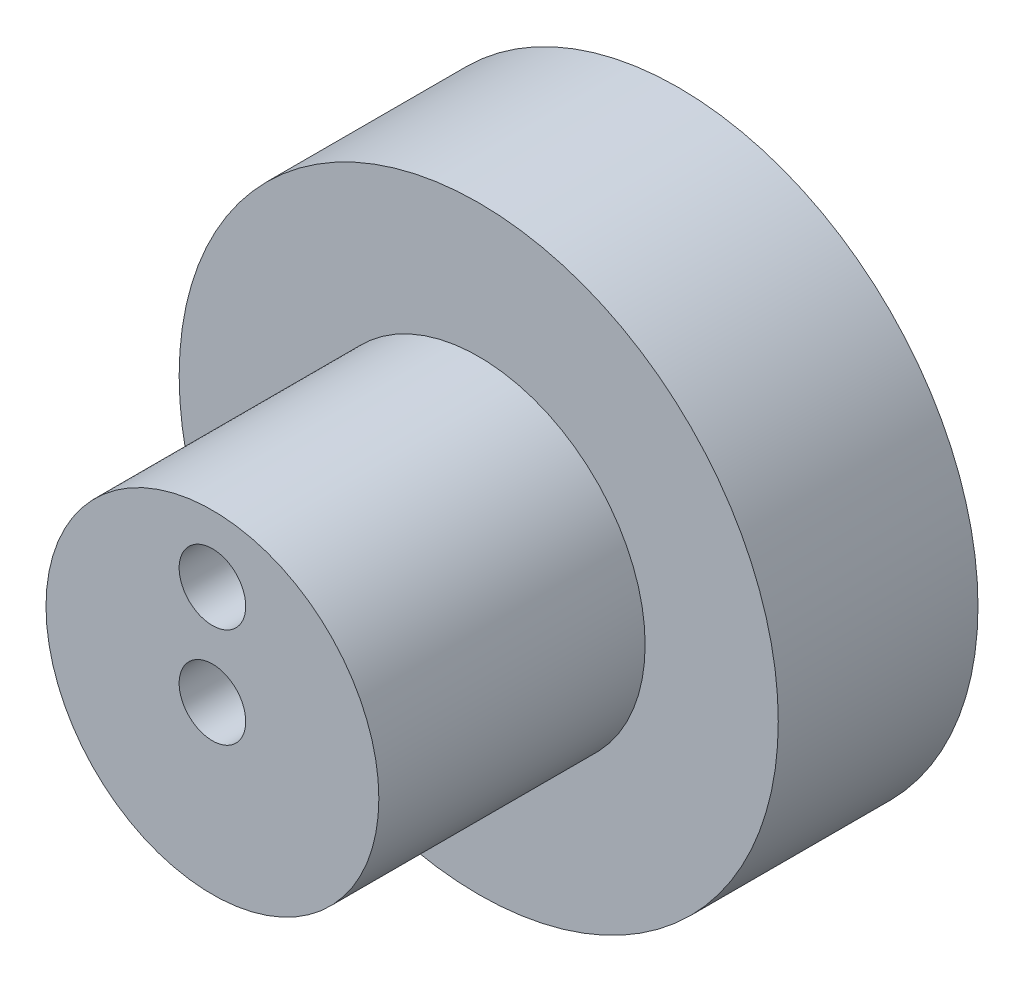
ISO-10303-21;
HEADER;
FILE_DESCRIPTION(('STEP AP214'),'2;1');
FILE_NAME('part.step','',(''),(''),'','','');
FILE_SCHEMA(('AUTOMOTIVE_DESIGN { 1 0 10303 214 1 1 1 1 }'));
ENDSEC;
DATA;
#1=APPLICATION_CONTEXT('core data for automotive mechanical design processes');
#2=APPLICATION_PROTOCOL_DEFINITION('international standard','automotive_design',2000,#1);
#3=PRODUCT_CONTEXT('',#1,'mechanical');
#4=PRODUCT('Part','Part','',(#3));
#5=PRODUCT_RELATED_PRODUCT_CATEGORY('part','',(#4));
#6=PRODUCT_DEFINITION_FORMATION('','',#4);
#7=PRODUCT_DEFINITION_CONTEXT('part definition',#1,'design');
#8=PRODUCT_DEFINITION('design','',#6,#7);
#9=PRODUCT_DEFINITION_SHAPE('','',#8);
#10=(LENGTH_UNIT() NAMED_UNIT(*) SI_UNIT(.MILLI.,.METRE.));
#11=(NAMED_UNIT(*) PLANE_ANGLE_UNIT() SI_UNIT($,.RADIAN.));
#12=(NAMED_UNIT(*) SI_UNIT($,.STERADIAN.) SOLID_ANGLE_UNIT());
#13=UNCERTAINTY_MEASURE_WITH_UNIT(LENGTH_MEASURE(1.E-05),#10,'distance_accuracy_value','');
#14=(GEOMETRIC_REPRESENTATION_CONTEXT(3) GLOBAL_UNCERTAINTY_ASSIGNED_CONTEXT((#13)) GLOBAL_UNIT_ASSIGNED_CONTEXT((#10,
#11,#12)) REPRESENTATION_CONTEXT('',''));
#15=CARTESIAN_POINT('',(0.,0.,0.));
#16=DIRECTION('',(0.,0.,1.));
#17=DIRECTION('',(1.,0.,0.));
#18=AXIS2_PLACEMENT_3D('',#15,#16,#17);
#19=CARTESIAN_POINT('',(0.,0.,30.));
#20=DIRECTION('',(0.,0.,0.999999999999994));
#21=DIRECTION('',(1.00000000000002,0.,0.));
#22=AXIS2_PLACEMENT_3D('',#19,#20,#21);
#23=PLANE('',#22);
#24=CARTESIAN_POINT('',(0.,0.,30.));
#25=DIRECTION('',(0.,0.,0.999999999999994));
#26=DIRECTION('',(1.00000000000002,0.,0.));
#27=AXIS2_PLACEMENT_3D('',#24,#25,#26);
#28=CIRCLE('',#27,45.);
#29=CARTESIAN_POINT('',(45.0000000000007,0.,30.));
#30=VERTEX_POINT('',#29);
#31=EDGE_CURVE('E10',#30,#30,#28,.T.);
#32=ORIENTED_EDGE('',*,*,#31,.T.);
#33=EDGE_LOOP('',(#32));
#34=FACE_BOUND('',#33,.T.);
#35=CARTESIAN_POINT('',(0.,0.,30.));
#36=DIRECTION('',(0.,0.,0.999999999999994));
#37=DIRECTION('',(1.00000000000002,0.,0.));
#38=AXIS2_PLACEMENT_3D('',#35,#36,#37);
#39=CIRCLE('',#38,25.);
#40=CARTESIAN_POINT('',(25.0000000000004,0.,30.));
#41=VERTEX_POINT('',#40);
#42=EDGE_CURVE('E43',#41,#41,#39,.T.);
#43=ORIENTED_EDGE('',*,*,#42,.F.);
#44=EDGE_LOOP('',(#43));
#45=FACE_BOUND('',#44,.T.);
#46=ADVANCED_FACE('F30',(#34,#45),#23,.T.);
#47=CARTESIAN_POINT('',(0.,0.,30.));
#48=DIRECTION('',(0.,0.,-0.999999999999994));
#49=DIRECTION('',(-1.00000000000002,0.,0.));
#50=AXIS2_PLACEMENT_3D('',#47,#48,#49);
#51=CYLINDRICAL_SURFACE('',#50,45.);
#52=ORIENTED_EDGE('',*,*,#31,.F.);
#53=EDGE_LOOP('',(#52));
#54=FACE_BOUND('',#53,.T.);
#55=CARTESIAN_POINT('',(0.,0.,0.));
#56=DIRECTION('',(0.,0.,0.999999999999994));
#57=DIRECTION('',(1.00000000000002,0.,0.));
#58=AXIS2_PLACEMENT_3D('',#55,#56,#57);
#59=CIRCLE('',#58,45.);
#60=CARTESIAN_POINT('',(45.0000000000007,0.,0.));
#61=VERTEX_POINT('',#60);
#62=EDGE_CURVE('E34',#61,#61,#59,.T.);
#63=ORIENTED_EDGE('',*,*,#62,.T.);
#64=EDGE_LOOP('',(#63));
#65=FACE_BOUND('',#64,.T.);
#66=ADVANCED_FACE('F32',(#54,#65),#51,.T.);
#67=CARTESIAN_POINT('',(0.,0.,0.));
#68=DIRECTION('',(0.,0.,0.999999999999994));
#69=DIRECTION('',(1.00000000000002,0.,0.));
#70=AXIS2_PLACEMENT_3D('',#67,#68,#69);
#71=PLANE('',#70);
#72=CARTESIAN_POINT('',(0.,15.0000000000001,0.));
#73=DIRECTION('',(0.,0.,-0.999999999999994));
#74=DIRECTION('',(-1.00000000000002,0.,0.));
#75=AXIS2_PLACEMENT_3D('',#72,#73,#74);
#76=CIRCLE('',#75,5.);
#77=CARTESIAN_POINT('',(-5.00000000000008,15.0000000000001,0.));
#78=VERTEX_POINT('',#77);
#79=EDGE_CURVE('E61',#78,#78,#76,.T.);
#80=ORIENTED_EDGE('',*,*,#79,.F.);
#81=EDGE_LOOP('',(#80));
#82=FACE_BOUND('',#81,.T.);
#83=CARTESIAN_POINT('',(0.,0.,0.));
#84=DIRECTION('',(0.,0.,0.999999999999994));
#85=DIRECTION('',(1.00000000000002,0.,0.));
#86=AXIS2_PLACEMENT_3D('',#83,#84,#85);
#87=CIRCLE('',#86,5.);
#88=CARTESIAN_POINT('',(5.00000000000008,0.,0.));
#89=VERTEX_POINT('',#88);
#90=EDGE_CURVE('E46',#89,#89,#87,.T.);
#91=ORIENTED_EDGE('',*,*,#90,.T.);
#92=EDGE_LOOP('',(#91));
#93=FACE_BOUND('',#92,.T.);
#94=ORIENTED_EDGE('',*,*,#62,.F.);
#95=EDGE_LOOP('',(#94));
#96=FACE_BOUND('',#95,.T.);
#97=ADVANCED_FACE('F76',(#82,#93,#96),#71,.F.);
#98=CARTESIAN_POINT('',(0.,0.,69.9999999999995));
#99=DIRECTION('',(0.,0.,-0.999999999999994));
#100=DIRECTION('',(-1.00000000000002,0.,0.));
#101=AXIS2_PLACEMENT_3D('',#98,#99,#100);
#102=CYLINDRICAL_SURFACE('',#101,25.);
#103=CARTESIAN_POINT('',(0.,0.,69.9999999999995));
#104=DIRECTION('',(0.,0.,0.999999999999994));
#105=DIRECTION('',(1.00000000000002,0.,0.));
#106=AXIS2_PLACEMENT_3D('',#103,#104,#105);
#107=CIRCLE('',#106,25.);
#108=CARTESIAN_POINT('',(25.0000000000004,0.,69.9999999999995));
#109=VERTEX_POINT('',#108);
#110=EDGE_CURVE('E41',#109,#109,#107,.T.);
#111=ORIENTED_EDGE('',*,*,#110,.F.);
#112=EDGE_LOOP('',(#111));
#113=FACE_BOUND('',#112,.T.);
#114=ORIENTED_EDGE('',*,*,#42,.T.);
#115=EDGE_LOOP('',(#114));
#116=FACE_BOUND('',#115,.T.);
#117=ADVANCED_FACE('F79',(#113,#116),#102,.T.);
#118=CARTESIAN_POINT('',(0.,0.,69.9999999999995));
#119=DIRECTION('',(0.,0.,0.999999999999994));
#120=DIRECTION('',(1.00000000000002,0.,0.));
#121=AXIS2_PLACEMENT_3D('',#118,#119,#120);
#122=PLANE('',#121);
#123=CARTESIAN_POINT('',(0.,15.0000000000001,69.9999999999995));
#124=DIRECTION('',(0.,0.,0.999999999999994));
#125=DIRECTION('',(1.00000000000002,0.,0.));
#126=AXIS2_PLACEMENT_3D('',#123,#124,#125);
#127=CIRCLE('',#126,5.);
#128=CARTESIAN_POINT('',(5.00000000000013,15.0000000000001,69.9999999999995));
#129=VERTEX_POINT('',#128);
#130=EDGE_CURVE('E55',#129,#129,#127,.T.);
#131=ORIENTED_EDGE('',*,*,#130,.F.);
#132=EDGE_LOOP('',(#131));
#133=FACE_BOUND('',#132,.T.);
#134=CARTESIAN_POINT('',(0.,0.,69.9999999999995));
#135=DIRECTION('',(0.,0.,0.999999999999994));
#136=DIRECTION('',(1.00000000000002,0.,0.));
#137=AXIS2_PLACEMENT_3D('',#134,#135,#136);
#138=CIRCLE('',#137,5.);
#139=CARTESIAN_POINT('',(5.00000000000008,0.,69.9999999999995));
#140=VERTEX_POINT('',#139);
#141=EDGE_CURVE('E49',#140,#140,#138,.T.);
#142=ORIENTED_EDGE('',*,*,#141,.F.);
#143=EDGE_LOOP('',(#142));
#144=FACE_BOUND('',#143,.T.);
#145=ORIENTED_EDGE('',*,*,#110,.T.);
#146=EDGE_LOOP('',(#145));
#147=FACE_BOUND('',#146,.T.);
#148=ADVANCED_FACE('F96',(#133,#144,#147),#122,.T.);
#149=CARTESIAN_POINT('',(0.,0.,0.));
#150=DIRECTION('',(0.,0.,0.999999999999994));
#151=DIRECTION('',(1.00000000000002,0.,0.));
#152=AXIS2_PLACEMENT_3D('',#149,#150,#151);
#153=CYLINDRICAL_SURFACE('',#152,5.);
#154=ORIENTED_EDGE('',*,*,#90,.F.);
#155=EDGE_LOOP('',(#154));
#156=FACE_BOUND('',#155,.T.);
#157=ORIENTED_EDGE('',*,*,#141,.T.);
#158=EDGE_LOOP('',(#157));
#159=FACE_BOUND('',#158,.T.);
#160=ADVANCED_FACE('F100',(#156,#159),#153,.F.);
#161=CARTESIAN_POINT('',(0.,15.0000000000001,59.9999999999995));
#162=DIRECTION('',(0.,0.,0.999999999999994));
#163=DIRECTION('',(1.00000000000002,0.,0.));
#164=AXIS2_PLACEMENT_3D('',#161,#162,#163);
#165=CYLINDRICAL_SURFACE('',#164,5.);
#166=CARTESIAN_POINT('',(0.,15.0000000000001,59.9999999999995));
#167=DIRECTION('',(0.,0.,0.999999999999994));
#168=DIRECTION('',(1.00000000000002,0.,0.));
#169=AXIS2_PLACEMENT_3D('',#166,#167,#168);
#170=CIRCLE('',#169,5.);
#171=CARTESIAN_POINT('',(5.00000000000008,15.0000000000001,59.9999999999995));
#172=VERTEX_POINT('',#171);
#173=EDGE_CURVE('E52',#172,#172,#170,.T.);
#174=ORIENTED_EDGE('',*,*,#173,.F.);
#175=EDGE_LOOP('',(#174));
#176=FACE_BOUND('',#175,.T.);
#177=ORIENTED_EDGE('',*,*,#130,.T.);
#178=EDGE_LOOP('',(#177));
#179=FACE_BOUND('',#178,.T.);
#180=ADVANCED_FACE('F104',(#176,#179),#165,.F.);
#181=CARTESIAN_POINT('',(0.,15.0000000000001,59.9999999999995));
#182=DIRECTION('',(0.,0.,0.999999999999994));
#183=DIRECTION('',(1.00000000000002,0.,0.));
#184=AXIS2_PLACEMENT_3D('',#181,#182,#183);
#185=PLANE('',#184);
#186=ORIENTED_EDGE('',*,*,#173,.T.);
#187=EDGE_LOOP('',(#186));
#188=FACE_BOUND('',#187,.T.);
#189=ADVANCED_FACE('F72',(#188),#185,.T.);
#190=CARTESIAN_POINT('',(0.,15.0000000000001,10.));
#191=DIRECTION('',(0.,0.,-0.999999999999994));
#192=DIRECTION('',(-1.00000000000002,0.,0.));
#193=AXIS2_PLACEMENT_3D('',#190,#191,#192);
#194=CYLINDRICAL_SURFACE('',#193,5.);
#195=CARTESIAN_POINT('',(0.,15.0000000000001,10.));
#196=DIRECTION('',(0.,0.,-0.999999999999994));
#197=DIRECTION('',(-1.00000000000002,0.,0.));
#198=AXIS2_PLACEMENT_3D('',#195,#196,#197);
#199=CIRCLE('',#198,5.);
#200=CARTESIAN_POINT('',(-5.00000000000002,15.0000000000001,10.));
#201=VERTEX_POINT('',#200);
#202=EDGE_CURVE('E58',#201,#201,#199,.T.);
#203=ORIENTED_EDGE('',*,*,#202,.F.);
#204=EDGE_LOOP('',(#203));
#205=FACE_BOUND('',#204,.T.);
#206=ORIENTED_EDGE('',*,*,#79,.T.);
#207=EDGE_LOOP('',(#206));
#208=FACE_BOUND('',#207,.T.);
#209=ADVANCED_FACE('F69',(#205,#208),#194,.F.);
#210=CARTESIAN_POINT('',(0.,15.0000000000001,10.));
#211=DIRECTION('',(0.,0.,-0.999999999999994));
#212=DIRECTION('',(-1.00000000000002,0.,0.));
#213=AXIS2_PLACEMENT_3D('',#210,#211,#212);
#214=PLANE('',#213);
#215=ORIENTED_EDGE('',*,*,#202,.T.);
#216=EDGE_LOOP('',(#215));
#217=FACE_BOUND('',#216,.T.);
#218=ADVANCED_FACE('F67',(#217),#214,.T.);
#219=CLOSED_SHELL('',(#46,#66,#97,#117,#148,#160,#180,#189,#209,#218));
#220=MANIFOLD_SOLID_BREP('B2',#219);
#221=ADVANCED_BREP_SHAPE_REPRESENTATION('',(#18,#220),#14);
#222=SHAPE_DEFINITION_REPRESENTATION(#9,#221);
ENDSEC;
END-ISO-10303-21;
